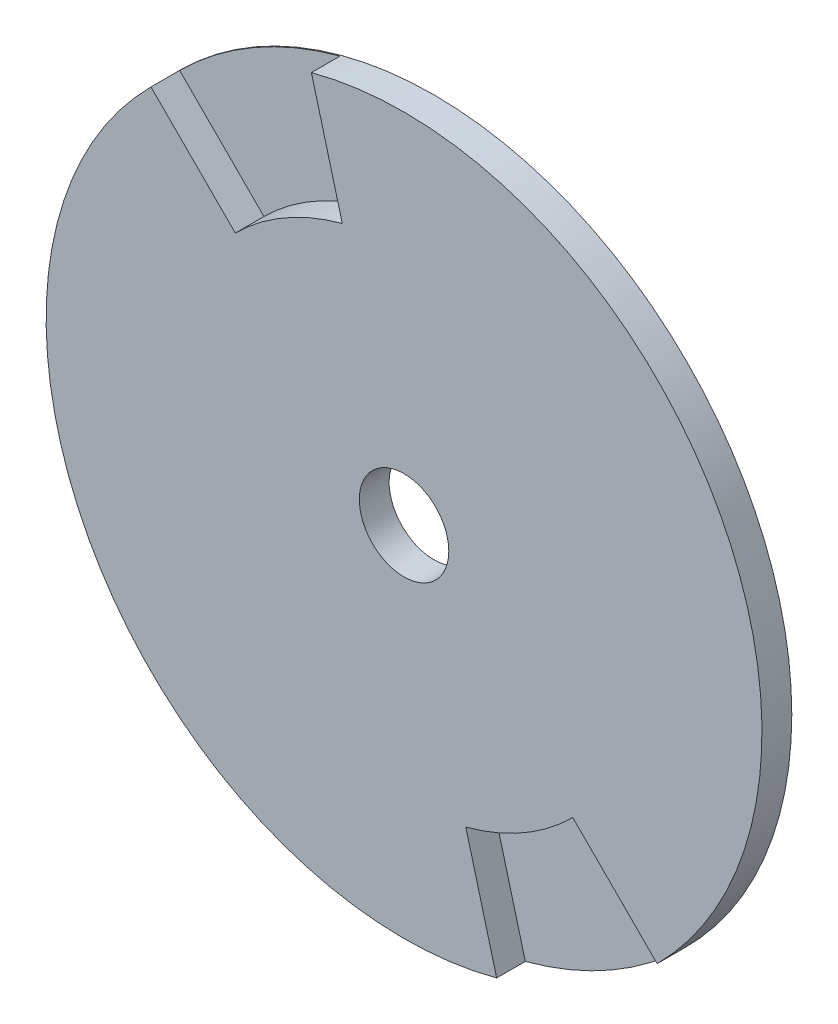
ISO-10303-21;
HEADER;
FILE_DESCRIPTION(('STEP AP214'),'2;1');
FILE_NAME('part.step','',(''),(''),'','','');
FILE_SCHEMA(('AUTOMOTIVE_DESIGN { 1 0 10303 214 1 1 1 1 }'));
ENDSEC;
DATA;
#1=APPLICATION_CONTEXT('core data for automotive mechanical design processes');
#2=APPLICATION_PROTOCOL_DEFINITION('international standard','automotive_design',2000,#1);
#3=PRODUCT_CONTEXT('',#1,'mechanical');
#4=PRODUCT('Part','Part','',(#3));
#5=PRODUCT_RELATED_PRODUCT_CATEGORY('part','',(#4));
#6=PRODUCT_DEFINITION_FORMATION('','',#4);
#7=PRODUCT_DEFINITION_CONTEXT('part definition',#1,'design');
#8=PRODUCT_DEFINITION('design','',#6,#7);
#9=PRODUCT_DEFINITION_SHAPE('','',#8);
#10=(LENGTH_UNIT() NAMED_UNIT(*) SI_UNIT(.MILLI.,.METRE.));
#11=(NAMED_UNIT(*) PLANE_ANGLE_UNIT() SI_UNIT($,.RADIAN.));
#12=(NAMED_UNIT(*) SI_UNIT($,.STERADIAN.) SOLID_ANGLE_UNIT());
#13=UNCERTAINTY_MEASURE_WITH_UNIT(LENGTH_MEASURE(1.E-05),#10,'distance_accuracy_value','');
#14=(GEOMETRIC_REPRESENTATION_CONTEXT(3) GLOBAL_UNCERTAINTY_ASSIGNED_CONTEXT((#13)) GLOBAL_UNIT_ASSIGNED_CONTEXT((#10,
#11,#12)) REPRESENTATION_CONTEXT('',''));
#15=CARTESIAN_POINT('',(0.,0.,0.));
#16=DIRECTION('',(0.,0.,1.));
#17=DIRECTION('',(1.,0.,0.));
#18=AXIS2_PLACEMENT_3D('',#15,#16,#17);
#19=CARTESIAN_POINT('',(0.,0.,1.5875));
#20=DIRECTION('',(0.,0.,-1.));
#21=DIRECTION('',(-1.,0.,0.));
#22=AXIS2_PLACEMENT_3D('',#19,#20,#21);
#23=CYLINDRICAL_SURFACE('',#22,19.05);
#24=CARTESIAN_POINT('',(0.,0.,1.5875));
#25=DIRECTION('',(0.,0.,1.));
#26=DIRECTION('',(1.,0.,0.));
#27=AXIS2_PLACEMENT_3D('',#24,#25,#26);
#28=CIRCLE('',#27,19.05);
#29=CARTESIAN_POINT('',(13.4703841816039,-13.4703841816036,1.5875));
#30=VERTEX_POINT('',#29);
#31=CARTESIAN_POINT('',(-4.93050280920271,18.4008869908068,1.5875));
#32=VERTEX_POINT('',#31);
#33=EDGE_CURVE('E41',#30,#32,#28,.T.);
#34=ORIENTED_EDGE('',*,*,#33,.F.);
#35=DIRECTION('',(0.,0.,1.));
#36=VECTOR('',#35,1.);
#37=CARTESIAN_POINT('',(13.4703841816039,-13.4703841816036,0.0635));
#38=LINE('',#37,#36);
#39=CARTESIAN_POINT('',(13.4703841816039,-13.4703841816036,0.0635));
#40=VERTEX_POINT('',#39);
#41=EDGE_CURVE('E130',#40,#30,#38,.T.);
#42=ORIENTED_EDGE('',*,*,#41,.F.);
#43=CARTESIAN_POINT('',(0.,0.,0.0635));
#44=DIRECTION('',(0.,0.,1.));
#45=DIRECTION('',(1.,0.,0.));
#46=AXIS2_PLACEMENT_3D('',#43,#44,#45);
#47=CIRCLE('',#46,19.05);
#48=CARTESIAN_POINT('',(4.93050280920348,-18.4008869908066,0.0635));
#49=VERTEX_POINT('',#48);
#50=EDGE_CURVE('E108',#49,#40,#47,.T.);
#51=ORIENTED_EDGE('',*,*,#50,.F.);
#52=DIRECTION('',(0.,0.,1.));
#53=VECTOR('',#52,1.);
#54=CARTESIAN_POINT('',(4.93050280920348,-18.4008869908066,0.0635));
#55=LINE('',#54,#53);
#56=CARTESIAN_POINT('',(4.93050280920348,-18.4008869908066,1.5875));
#57=VERTEX_POINT('',#56);
#58=EDGE_CURVE('E104',#49,#57,#55,.T.);
#59=ORIENTED_EDGE('',*,*,#58,.T.);
#60=CARTESIAN_POINT('',(-13.4703841816033,13.4703841816041,1.5875));
#61=VERTEX_POINT('',#60);
#62=EDGE_CURVE('E11',#61,#57,#28,.T.);
#63=ORIENTED_EDGE('',*,*,#62,.F.);
#64=DIRECTION('',(0.,0.,1.));
#65=VECTOR('',#64,1.);
#66=CARTESIAN_POINT('',(-13.4703841816033,13.4703841816041,0.0635));
#67=LINE('',#66,#65);
#68=CARTESIAN_POINT('',(-13.4703841816033,13.4703841816041,0.0635));
#69=VERTEX_POINT('',#68);
#70=EDGE_CURVE('E152',#69,#61,#67,.T.);
#71=ORIENTED_EDGE('',*,*,#70,.F.);
#72=CARTESIAN_POINT('',(0.,0.,0.0635));
#73=DIRECTION('',(0.,0.,1.));
#74=DIRECTION('',(1.,0.,0.));
#75=AXIS2_PLACEMENT_3D('',#72,#73,#74);
#76=CIRCLE('',#75,19.05);
#77=CARTESIAN_POINT('',(-4.93050280920271,18.4008869908068,0.0635));
#78=VERTEX_POINT('',#77);
#79=EDGE_CURVE('E142',#78,#69,#76,.T.);
#80=ORIENTED_EDGE('',*,*,#79,.F.);
#81=DIRECTION('',(0.,0.,1.));
#82=VECTOR('',#81,1.);
#83=CARTESIAN_POINT('',(-4.93050280920271,18.4008869908068,0.0635));
#84=LINE('',#83,#82);
#85=EDGE_CURVE('E155',#78,#32,#84,.T.);
#86=ORIENTED_EDGE('',*,*,#85,.T.);
#87=EDGE_LOOP('',(#34,#42,#51,#59,#63,#71,#80,#86));
#88=FACE_BOUND('',#87,.T.);
#89=CARTESIAN_POINT('',(0.,0.,0.));
#90=DIRECTION('',(0.,0.,1.));
#91=DIRECTION('',(1.,0.,0.));
#92=AXIS2_PLACEMENT_3D('',#89,#90,#91);
#93=CIRCLE('',#92,19.05);
#94=CARTESIAN_POINT('',(19.05,0.,0.));
#95=VERTEX_POINT('',#94);
#96=EDGE_CURVE('E162',#95,#95,#93,.T.);
#97=ORIENTED_EDGE('',*,*,#96,.T.);
#98=EDGE_LOOP('',(#97));
#99=FACE_BOUND('',#98,.T.);
#100=ADVANCED_FACE('F33',(#88,#99),#23,.T.);
#101=CARTESIAN_POINT('',(0.,0.,1.5875));
#102=DIRECTION('',(0.,0.,1.));
#103=DIRECTION('',(1.,0.,0.));
#104=AXIS2_PLACEMENT_3D('',#101,#102,#103);
#105=PLANE('',#104);
#106=DIRECTION('',(-0.707106781186556,0.707106781186539,0.));
#107=VECTOR('',#106,1.);
#108=CARTESIAN_POINT('',(21.0257106781187,-21.0257106781181,1.5875));
#109=LINE('',#108,#107);
#110=CARTESIAN_POINT('',(8.98025612106927,-8.98025612106904,1.5875));
#111=VERTEX_POINT('',#110);
#112=EDGE_CURVE('E118',#30,#111,#109,.T.);
#113=ORIENTED_EDGE('',*,*,#112,.F.);
#114=ORIENTED_EDGE('',*,*,#33,.T.);
#115=DIRECTION('',(0.258819045102504,-0.965925826289073,0.));
#116=VECTOR('',#115,1.);
#117=CARTESIAN_POINT('',(10.5128553390587,-39.2345102579915,1.5875));
#118=LINE('',#117,#116);
#119=CARTESIAN_POINT('',(-3.28700187280181,12.2672579938712,1.5875));
#120=VERTEX_POINT('',#119);
#121=EDGE_CURVE('E137',#32,#120,#118,.T.);
#122=ORIENTED_EDGE('',*,*,#121,.T.);
#123=CARTESIAN_POINT('',(0.,0.,1.5875));
#124=DIRECTION('',(0.,0.,1.));
#125=DIRECTION('',(1.,0.,0.));
#126=AXIS2_PLACEMENT_3D('',#123,#124,#125);
#127=CIRCLE('',#126,12.7);
#128=CARTESIAN_POINT('',(-8.98025612106889,8.98025612106942,1.5875));
#129=VERTEX_POINT('',#128);
#130=EDGE_CURVE('E147',#129,#120,#127,.F.);
#131=ORIENTED_EDGE('',*,*,#130,.F.);
#132=DIRECTION('',(0.707106781186527,-0.707106781186569,0.));
#133=VECTOR('',#132,1.);
#134=CARTESIAN_POINT('',(21.0257106781187,-21.0257106781199,1.5875));
#135=LINE('',#134,#133);
#136=EDGE_CURVE('E57',#61,#129,#135,.T.);
#137=ORIENTED_EDGE('',*,*,#136,.F.);
#138=ORIENTED_EDGE('',*,*,#62,.T.);
#139=DIRECTION('',(-0.258819045102545,0.965925826289062,0.));
#140=VECTOR('',#139,1.);
#141=CARTESIAN_POINT('',(10.5128553390602,-39.2345102579906,1.5875));
#142=LINE('',#141,#140);
#143=CARTESIAN_POINT('',(3.28700187280232,-12.2672579938711,1.5875));
#144=VERTEX_POINT('',#143);
#145=EDGE_CURVE('E121',#57,#144,#142,.T.);
#146=ORIENTED_EDGE('',*,*,#145,.T.);
#147=CARTESIAN_POINT('',(0.,0.,1.5875));
#148=DIRECTION('',(0.,0.,1.));
#149=DIRECTION('',(1.,0.,0.));
#150=AXIS2_PLACEMENT_3D('',#147,#148,#149);
#151=CIRCLE('',#150,12.7);
#152=EDGE_CURVE('E49',#144,#111,#151,.T.);
#153=ORIENTED_EDGE('',*,*,#152,.T.);
#154=EDGE_LOOP('',(#113,#114,#122,#131,#137,#138,#146,#153));
#155=FACE_BOUND('',#154,.T.);
#156=CARTESIAN_POINT('',(0.,0.,1.5875));
#157=DIRECTION('',(0.,0.,1.));
#158=DIRECTION('',(1.,0.,0.));
#159=AXIS2_PLACEMENT_3D('',#156,#157,#158);
#160=CIRCLE('',#159,2.38125);
#161=CARTESIAN_POINT('',(2.38125,0.,1.5875));
#162=VERTEX_POINT('',#161);
#163=EDGE_CURVE('E154',#162,#162,#160,.T.);
#164=ORIENTED_EDGE('',*,*,#163,.F.);
#165=EDGE_LOOP('',(#164));
#166=FACE_BOUND('',#165,.T.);
#167=ADVANCED_FACE('F183',(#155,#166),#105,.T.);
#168=CARTESIAN_POINT('',(0.,0.,0.));
#169=DIRECTION('',(0.,0.,1.));
#170=DIRECTION('',(1.,0.,0.));
#171=AXIS2_PLACEMENT_3D('',#168,#169,#170);
#172=PLANE('',#171);
#173=CARTESIAN_POINT('',(0.,0.,0.));
#174=DIRECTION('',(0.,0.,1.));
#175=DIRECTION('',(1.,0.,0.));
#176=AXIS2_PLACEMENT_3D('',#173,#174,#175);
#177=CIRCLE('',#176,2.38125);
#178=CARTESIAN_POINT('',(2.38125,0.,0.));
#179=VERTEX_POINT('',#178);
#180=EDGE_CURVE('E36',#179,#179,#177,.T.);
#181=ORIENTED_EDGE('',*,*,#180,.T.);
#182=EDGE_LOOP('',(#181));
#183=FACE_BOUND('',#182,.T.);
#184=ORIENTED_EDGE('',*,*,#96,.F.);
#185=EDGE_LOOP('',(#184));
#186=FACE_BOUND('',#185,.T.);
#187=ADVANCED_FACE('F169',(#183,#186),#172,.F.);
#188=CARTESIAN_POINT('',(0.,0.,-1.5875));
#189=DIRECTION('',(0.,0.,1.));
#190=DIRECTION('',(1.,0.,0.));
#191=AXIS2_PLACEMENT_3D('',#188,#189,#190);
#192=CYLINDRICAL_SURFACE('',#191,2.38125);
#193=ORIENTED_EDGE('',*,*,#163,.T.);
#194=EDGE_LOOP('',(#193));
#195=FACE_BOUND('',#194,.T.);
#196=ORIENTED_EDGE('',*,*,#180,.F.);
#197=EDGE_LOOP('',(#196));
#198=FACE_BOUND('',#197,.T.);
#199=ADVANCED_FACE('F172',(#195,#198),#192,.F.);
#200=CARTESIAN_POINT('',(21.0257106781187,-21.0257106781199,0.0635));
#201=DIRECTION('',(-0.707106781186569,-0.707106781186527,0.));
#202=DIRECTION('',(0.707106781186527,-0.707106781186569,0.));
#203=AXIS2_PLACEMENT_3D('',#200,#201,#202);
#204=PLANE('',#203);
#205=ORIENTED_EDGE('',*,*,#136,.T.);
#206=DIRECTION('',(0.,0.,1.));
#207=VECTOR('',#206,1.);
#208=CARTESIAN_POINT('',(-8.98025612106889,8.98025612106942,0.0635));
#209=LINE('',#208,#207);
#210=CARTESIAN_POINT('',(-8.98025612106889,8.98025612106942,0.0635));
#211=VERTEX_POINT('',#210);
#212=EDGE_CURVE('E145',#211,#129,#209,.T.);
#213=ORIENTED_EDGE('',*,*,#212,.F.);
#214=DIRECTION('',(0.707106781186527,-0.707106781186569,0.));
#215=VECTOR('',#214,1.);
#216=CARTESIAN_POINT('',(21.0257106781187,-21.0257106781199,0.0635));
#217=LINE('',#216,#215);
#218=EDGE_CURVE('E133',#69,#211,#217,.T.);
#219=ORIENTED_EDGE('',*,*,#218,.F.);
#220=ORIENTED_EDGE('',*,*,#70,.T.);
#221=EDGE_LOOP('',(#205,#213,#219,#220));
#222=FACE_BOUND('',#221,.T.);
#223=ADVANCED_FACE('F174',(#222),#204,.F.);
#224=CARTESIAN_POINT('',(10.5128553390587,-39.2345102579915,0.0635));
#225=DIRECTION('',(-0.965925826289073,-0.258819045102504,0.));
#226=DIRECTION('',(0.258819045102504,-0.965925826289073,0.));
#227=AXIS2_PLACEMENT_3D('',#224,#225,#226);
#228=PLANE('',#227);
#229=ORIENTED_EDGE('',*,*,#121,.F.);
#230=ORIENTED_EDGE('',*,*,#85,.F.);
#231=DIRECTION('',(0.258819045102504,-0.965925826289073,0.));
#232=VECTOR('',#231,1.);
#233=CARTESIAN_POINT('',(10.5128553390587,-39.2345102579915,0.0635));
#234=LINE('',#233,#232);
#235=CARTESIAN_POINT('',(-3.28700187280181,12.2672579938712,0.0635));
#236=VERTEX_POINT('',#235);
#237=EDGE_CURVE('E140',#78,#236,#234,.T.);
#238=ORIENTED_EDGE('',*,*,#237,.T.);
#239=DIRECTION('',(0.,0.,1.));
#240=VECTOR('',#239,1.);
#241=CARTESIAN_POINT('',(-3.28700187280181,12.2672579938712,0.0635));
#242=LINE('',#241,#240);
#243=EDGE_CURVE('E158',#236,#120,#242,.T.);
#244=ORIENTED_EDGE('',*,*,#243,.T.);
#245=EDGE_LOOP('',(#229,#230,#238,#244));
#246=FACE_BOUND('',#245,.T.);
#247=ADVANCED_FACE('F181',(#246),#228,.T.);
#248=CARTESIAN_POINT('',(0.,0.,0.0635));
#249=DIRECTION('',(0.,0.,1.));
#250=DIRECTION('',(1.,0.,0.));
#251=AXIS2_PLACEMENT_3D('',#248,#249,#250);
#252=CYLINDRICAL_SURFACE('',#251,12.7);
#253=ORIENTED_EDGE('',*,*,#130,.T.);
#254=ORIENTED_EDGE('',*,*,#243,.F.);
#255=CARTESIAN_POINT('',(0.,0.,0.0635));
#256=DIRECTION('',(0.,0.,1.));
#257=DIRECTION('',(1.,0.,0.));
#258=AXIS2_PLACEMENT_3D('',#255,#256,#257);
#259=CIRCLE('',#258,12.7);
#260=EDGE_CURVE('E136',#211,#236,#259,.F.);
#261=ORIENTED_EDGE('',*,*,#260,.F.);
#262=ORIENTED_EDGE('',*,*,#212,.T.);
#263=EDGE_LOOP('',(#253,#254,#261,#262));
#264=FACE_BOUND('',#263,.T.);
#265=ADVANCED_FACE('F203',(#264),#252,.T.);
#266=CARTESIAN_POINT('',(0.,-42.0514213562373,0.0635));
#267=DIRECTION('',(0.,0.,1.));
#268=DIRECTION('',(1.,0.,0.));
#269=AXIS2_PLACEMENT_3D('',#266,#267,#268);
#270=PLANE('',#269);
#271=ORIENTED_EDGE('',*,*,#218,.T.);
#272=ORIENTED_EDGE('',*,*,#260,.T.);
#273=ORIENTED_EDGE('',*,*,#237,.F.);
#274=ORIENTED_EDGE('',*,*,#79,.T.);
#275=EDGE_LOOP('',(#271,#272,#273,#274));
#276=FACE_BOUND('',#275,.T.);
#277=ADVANCED_FACE('F215',(#276),#270,.T.);
#278=CARTESIAN_POINT('',(0.,0.,0.0635));
#279=DIRECTION('',(0.,0.,1.));
#280=DIRECTION('',(1.,0.,0.));
#281=AXIS2_PLACEMENT_3D('',#278,#279,#280);
#282=CYLINDRICAL_SURFACE('',#281,12.7);
#283=ORIENTED_EDGE('',*,*,#152,.F.);
#284=DIRECTION('',(0.,0.,1.));
#285=VECTOR('',#284,1.);
#286=CARTESIAN_POINT('',(3.28700187280232,-12.2672579938711,0.0635));
#287=LINE('',#286,#285);
#288=CARTESIAN_POINT('',(3.28700187280232,-12.2672579938711,0.0635));
#289=VERTEX_POINT('',#288);
#290=EDGE_CURVE('E101',#289,#144,#287,.T.);
#291=ORIENTED_EDGE('',*,*,#290,.F.);
#292=CARTESIAN_POINT('',(0.,0.,0.0635));
#293=DIRECTION('',(0.,0.,1.));
#294=DIRECTION('',(1.,0.,0.));
#295=AXIS2_PLACEMENT_3D('',#292,#293,#294);
#296=CIRCLE('',#295,12.7);
#297=CARTESIAN_POINT('',(8.98025612106927,-8.98025612106904,0.0635));
#298=VERTEX_POINT('',#297);
#299=EDGE_CURVE('E109',#289,#298,#296,.T.);
#300=ORIENTED_EDGE('',*,*,#299,.T.);
#301=DIRECTION('',(0.,0.,1.));
#302=VECTOR('',#301,1.);
#303=CARTESIAN_POINT('',(8.98025612106927,-8.98025612106904,0.0635));
#304=LINE('',#303,#302);
#305=EDGE_CURVE('E128',#298,#111,#304,.T.);
#306=ORIENTED_EDGE('',*,*,#305,.T.);
#307=EDGE_LOOP('',(#283,#291,#300,#306));
#308=FACE_BOUND('',#307,.T.);
#309=ADVANCED_FACE('F111',(#308),#282,.T.);
#310=CARTESIAN_POINT('',(21.0257106781187,-21.0257106781181,0.0635));
#311=DIRECTION('',(0.707106781186539,0.707106781186556,0.));
#312=DIRECTION('',(-0.707106781186556,0.707106781186539,0.));
#313=AXIS2_PLACEMENT_3D('',#310,#311,#312);
#314=PLANE('',#313);
#315=ORIENTED_EDGE('',*,*,#112,.T.);
#316=ORIENTED_EDGE('',*,*,#305,.F.);
#317=DIRECTION('',(-0.707106781186556,0.707106781186539,0.));
#318=VECTOR('',#317,1.);
#319=CARTESIAN_POINT('',(21.0257106781187,-21.0257106781181,0.0635));
#320=LINE('',#319,#318);
#321=EDGE_CURVE('E113',#40,#298,#320,.T.);
#322=ORIENTED_EDGE('',*,*,#321,.F.);
#323=ORIENTED_EDGE('',*,*,#41,.T.);
#324=EDGE_LOOP('',(#315,#316,#322,#323));
#325=FACE_BOUND('',#324,.T.);
#326=ADVANCED_FACE('F207',(#325),#314,.F.);
#327=CARTESIAN_POINT('',(10.5128553390602,-39.2345102579906,0.0635));
#328=DIRECTION('',(0.965925826289062,0.258819045102545,0.));
#329=DIRECTION('',(-0.258819045102545,0.965925826289062,0.));
#330=AXIS2_PLACEMENT_3D('',#327,#328,#329);
#331=PLANE('',#330);
#332=ORIENTED_EDGE('',*,*,#145,.F.);
#333=ORIENTED_EDGE('',*,*,#58,.F.);
#334=DIRECTION('',(-0.258819045102545,0.965925826289062,0.));
#335=VECTOR('',#334,1.);
#336=CARTESIAN_POINT('',(10.5128553390602,-39.2345102579906,0.0635));
#337=LINE('',#336,#335);
#338=EDGE_CURVE('E99',#49,#289,#337,.T.);
#339=ORIENTED_EDGE('',*,*,#338,.T.);
#340=ORIENTED_EDGE('',*,*,#290,.T.);
#341=EDGE_LOOP('',(#332,#333,#339,#340));
#342=FACE_BOUND('',#341,.T.);
#343=ADVANCED_FACE('F100',(#342),#331,.T.);
#344=CARTESIAN_POINT('',(0.,-42.0514213562373,0.0635));
#345=DIRECTION('',(0.,0.,1.));
#346=DIRECTION('',(1.,0.,0.));
#347=AXIS2_PLACEMENT_3D('',#344,#345,#346);
#348=PLANE('',#347);
#349=ORIENTED_EDGE('',*,*,#299,.F.);
#350=ORIENTED_EDGE('',*,*,#338,.F.);
#351=ORIENTED_EDGE('',*,*,#50,.T.);
#352=ORIENTED_EDGE('',*,*,#321,.T.);
#353=EDGE_LOOP('',(#349,#350,#351,#352));
#354=FACE_BOUND('',#353,.T.);
#355=ADVANCED_FACE('F116',(#354),#348,.T.);
#356=CLOSED_SHELL('',(#100,#167,#187,#199,#223,#247,#265,#277,#309,#326,#343,#355));
#357=MANIFOLD_SOLID_BREP('B2',#356);
#358=ADVANCED_BREP_SHAPE_REPRESENTATION('',(#18,#357),#14);
#359=SHAPE_DEFINITION_REPRESENTATION(#9,#358);
ENDSEC;
END-ISO-10303-21;
